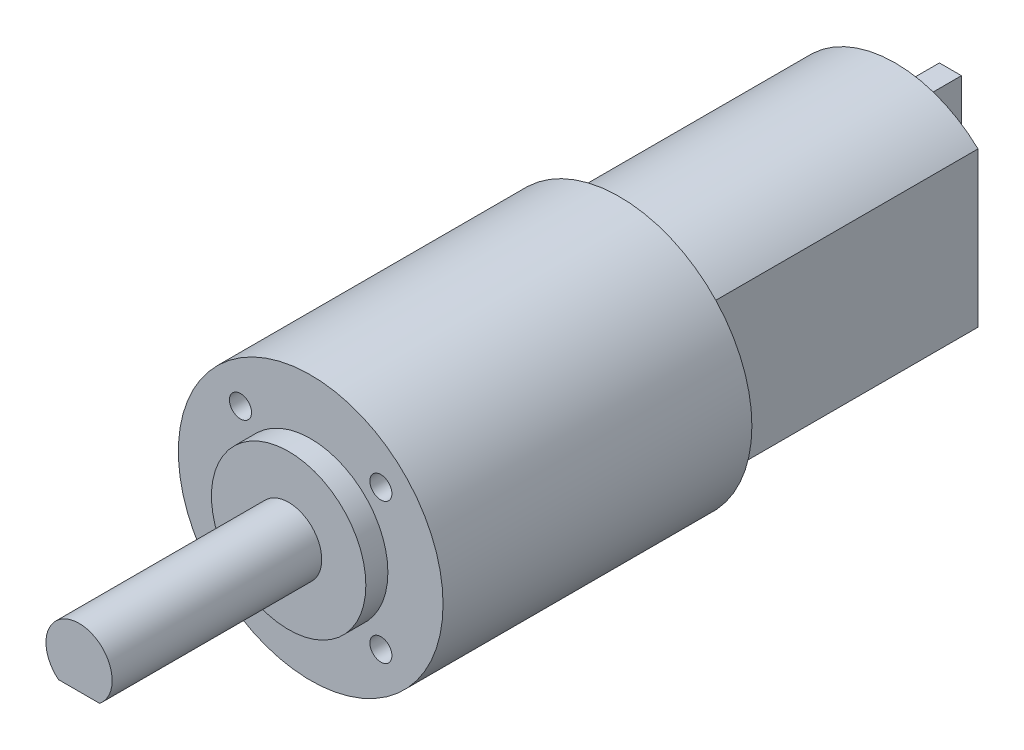
ISO-10303-21;
HEADER;
FILE_DESCRIPTION(('STEP AP214'),'2;1');
FILE_NAME('part.step','',(''),(''),'','','');
FILE_SCHEMA(('AUTOMOTIVE_DESIGN { 1 0 10303 214 1 1 1 1 }'));
ENDSEC;
DATA;
#1=APPLICATION_CONTEXT('core data for automotive mechanical design processes');
#2=APPLICATION_PROTOCOL_DEFINITION('international standard','automotive_design',2000,#1);
#3=PRODUCT_CONTEXT('',#1,'mechanical');
#4=PRODUCT('Part','Part','',(#3));
#5=PRODUCT_RELATED_PRODUCT_CATEGORY('part','',(#4));
#6=PRODUCT_DEFINITION_FORMATION('','',#4);
#7=PRODUCT_DEFINITION_CONTEXT('part definition',#1,'design');
#8=PRODUCT_DEFINITION('design','',#6,#7);
#9=PRODUCT_DEFINITION_SHAPE('','',#8);
#10=(LENGTH_UNIT() NAMED_UNIT(*) SI_UNIT(.MILLI.,.METRE.));
#11=(NAMED_UNIT(*) PLANE_ANGLE_UNIT() SI_UNIT($,.RADIAN.));
#12=(NAMED_UNIT(*) SI_UNIT($,.STERADIAN.) SOLID_ANGLE_UNIT());
#13=UNCERTAINTY_MEASURE_WITH_UNIT(LENGTH_MEASURE(1.E-05),#10,'distance_accuracy_value','');
#14=(GEOMETRIC_REPRESENTATION_CONTEXT(3) GLOBAL_UNCERTAINTY_ASSIGNED_CONTEXT((#13)) GLOBAL_UNIT_ASSIGNED_CONTEXT((#10,
#11,#12)) REPRESENTATION_CONTEXT('',''));
#15=CARTESIAN_POINT('',(0.,0.,0.));
#16=DIRECTION('',(0.,0.,1.));
#17=DIRECTION('',(1.,0.,0.));
#18=AXIS2_PLACEMENT_3D('',#15,#16,#17);
#19=CARTESIAN_POINT('',(0.,-0.875000000000001,0.));
#20=DIRECTION('',(0.,0.,-1.));
#21=DIRECTION('',(-1.,0.,0.));
#22=AXIS2_PLACEMENT_3D('',#19,#20,#21);
#23=PLANE('',#22);
#24=CARTESIAN_POINT('',(0.,-0.875000000000001,0.));
#25=DIRECTION('',(0.,0.,1.));
#26=DIRECTION('',(-1.,0.,0.));
#27=AXIS2_PLACEMENT_3D('',#24,#25,#26);
#28=CIRCLE('',#27,10.875);
#29=CARTESIAN_POINT('',(7.5,7.,0.));
#30=VERTEX_POINT('',#29);
#31=CARTESIAN_POINT('',(-7.5,7.,0.));
#32=VERTEX_POINT('',#31);
#33=EDGE_CURVE('E297',#30,#32,#28,.T.);
#34=ORIENTED_EDGE('',*,*,#33,.F.);
#35=DIRECTION('',(0.,1.,0.));
#36=VECTOR('',#35,1.);
#37=CARTESIAN_POINT('',(7.5,-7.,0.));
#38=LINE('',#37,#36);
#39=CARTESIAN_POINT('',(7.5,-7.,0.));
#40=VERTEX_POINT('',#39);
#41=EDGE_CURVE('E303',#40,#30,#38,.T.);
#42=ORIENTED_EDGE('',*,*,#41,.F.);
#43=CARTESIAN_POINT('',(0.,0.875000000000004,0.));
#44=DIRECTION('',(0.,0.,1.));
#45=DIRECTION('',(1.,0.,0.));
#46=AXIS2_PLACEMENT_3D('',#43,#44,#45);
#47=CIRCLE('',#46,10.875);
#48=CARTESIAN_POINT('',(-7.5,-7.,0.));
#49=VERTEX_POINT('',#48);
#50=EDGE_CURVE('E322',#49,#40,#47,.T.);
#51=ORIENTED_EDGE('',*,*,#50,.F.);
#52=DIRECTION('',(0.,-1.,0.));
#53=VECTOR('',#52,1.);
#54=CARTESIAN_POINT('',(-7.5,-7.,0.));
#55=LINE('',#54,#53);
#56=EDGE_CURVE('E319',#32,#49,#55,.T.);
#57=ORIENTED_EDGE('',*,*,#56,.F.);
#58=EDGE_LOOP('',(#34,#42,#51,#57));
#59=FACE_BOUND('',#58,.T.);
#60=DIRECTION('',(-1.,0.,0.));
#61=VECTOR('',#60,1.);
#62=CARTESIAN_POINT('',(-1.,3.,0.));
#63=LINE('',#62,#61);
#64=CARTESIAN_POINT('',(1.,3.,0.));
#65=VERTEX_POINT('',#64);
#66=CARTESIAN_POINT('',(-1.,3.,0.));
#67=VERTEX_POINT('',#66);
#68=EDGE_CURVE('E275',#65,#67,#63,.T.);
#69=ORIENTED_EDGE('',*,*,#68,.F.);
#70=DIRECTION('',(0.,-1.,0.));
#71=VECTOR('',#70,1.);
#72=CARTESIAN_POINT('',(1.,3.,0.));
#73=LINE('',#72,#71);
#74=CARTESIAN_POINT('',(1.,7.,0.));
#75=VERTEX_POINT('',#74);
#76=EDGE_CURVE('E245',#75,#65,#73,.T.);
#77=ORIENTED_EDGE('',*,*,#76,.F.);
#78=DIRECTION('',(1.,0.,0.));
#79=VECTOR('',#78,1.);
#80=CARTESIAN_POINT('',(-1.,7.,0.));
#81=LINE('',#80,#79);
#82=CARTESIAN_POINT('',(-1.,7.,0.));
#83=VERTEX_POINT('',#82);
#84=EDGE_CURVE('E262',#83,#75,#81,.T.);
#85=ORIENTED_EDGE('',*,*,#84,.F.);
#86=DIRECTION('',(0.,1.,0.));
#87=VECTOR('',#86,1.);
#88=CARTESIAN_POINT('',(-1.,3.,0.));
#89=LINE('',#88,#87);
#90=EDGE_CURVE('E278',#67,#83,#89,.T.);
#91=ORIENTED_EDGE('',*,*,#90,.F.);
#92=EDGE_LOOP('',(#69,#77,#85,#91));
#93=FACE_BOUND('',#92,.T.);
#94=DIRECTION('',(1.,0.,0.));
#95=VECTOR('',#94,1.);
#96=CARTESIAN_POINT('',(-1.,-3.,0.));
#97=LINE('',#96,#95);
#98=CARTESIAN_POINT('',(-1.,-3.,0.));
#99=VERTEX_POINT('',#98);
#100=CARTESIAN_POINT('',(1.,-3.,0.));
#101=VERTEX_POINT('',#100);
#102=EDGE_CURVE('E238',#99,#101,#97,.T.);
#103=ORIENTED_EDGE('',*,*,#102,.F.);
#104=DIRECTION('',(0.,1.,0.));
#105=VECTOR('',#104,1.);
#106=CARTESIAN_POINT('',(-1.,-3.,0.));
#107=LINE('',#106,#105);
#108=CARTESIAN_POINT('',(-1.,-7.,0.));
#109=VERTEX_POINT('',#108);
#110=EDGE_CURVE('E241',#109,#99,#107,.T.);
#111=ORIENTED_EDGE('',*,*,#110,.F.);
#112=DIRECTION('',(-1.,0.,0.));
#113=VECTOR('',#112,1.);
#114=CARTESIAN_POINT('',(-1.,-7.,0.));
#115=LINE('',#114,#113);
#116=CARTESIAN_POINT('',(1.,-7.,0.));
#117=VERTEX_POINT('',#116);
#118=EDGE_CURVE('E231',#117,#109,#115,.T.);
#119=ORIENTED_EDGE('',*,*,#118,.F.);
#120=DIRECTION('',(0.,-1.,0.));
#121=VECTOR('',#120,1.);
#122=CARTESIAN_POINT('',(1.,-3.,0.));
#123=LINE('',#122,#121);
#124=EDGE_CURVE('E234',#101,#117,#123,.T.);
#125=ORIENTED_EDGE('',*,*,#124,.F.);
#126=EDGE_LOOP('',(#103,#111,#119,#125));
#127=FACE_BOUND('',#126,.T.);
#128=ADVANCED_FACE('F45',(#59,#93,#127),#23,.T.);
#129=CARTESIAN_POINT('',(0.,-0.875000000000001,25.));
#130=DIRECTION('',(0.,0.,-1.));
#131=DIRECTION('',(-1.,0.,0.));
#132=AXIS2_PLACEMENT_3D('',#129,#130,#131);
#133=CYLINDRICAL_SURFACE('',#132,10.875);
#134=ORIENTED_EDGE('',*,*,#33,.T.);
#135=DIRECTION('',(0.,0.,-1.));
#136=VECTOR('',#135,1.);
#137=CARTESIAN_POINT('',(-7.5,7.,25.));
#138=LINE('',#137,#136);
#139=CARTESIAN_POINT('',(-7.5,7.,25.));
#140=VERTEX_POINT('',#139);
#141=EDGE_CURVE('E49',#140,#32,#138,.T.);
#142=ORIENTED_EDGE('',*,*,#141,.F.);
#143=CARTESIAN_POINT('',(0.,-0.875000000000001,25.));
#144=DIRECTION('',(0.,0.,1.));
#145=DIRECTION('',(-1.,0.,0.));
#146=AXIS2_PLACEMENT_3D('',#143,#144,#145);
#147=CIRCLE('',#146,10.875);
#148=CARTESIAN_POINT('',(7.5,7.,25.));
#149=VERTEX_POINT('',#148);
#150=EDGE_CURVE('E298',#149,#140,#147,.T.);
#151=ORIENTED_EDGE('',*,*,#150,.F.);
#152=DIRECTION('',(0.,0.,-1.));
#153=VECTOR('',#152,1.);
#154=CARTESIAN_POINT('',(7.5,7.,25.));
#155=LINE('',#154,#153);
#156=EDGE_CURVE('E315',#149,#30,#155,.T.);
#157=ORIENTED_EDGE('',*,*,#156,.T.);
#158=EDGE_LOOP('',(#134,#142,#151,#157));
#159=FACE_BOUND('',#158,.T.);
#160=ADVANCED_FACE('F47',(#159),#133,.T.);
#161=CARTESIAN_POINT('',(-7.5,-7.,25.));
#162=DIRECTION('',(1.,0.,0.));
#163=DIRECTION('',(0.,0.,-1.));
#164=AXIS2_PLACEMENT_3D('',#161,#162,#163);
#165=PLANE('',#164);
#166=ORIENTED_EDGE('',*,*,#56,.T.);
#167=DIRECTION('',(0.,0.,-1.));
#168=VECTOR('',#167,1.);
#169=CARTESIAN_POINT('',(-7.5,-7.,25.));
#170=LINE('',#169,#168);
#171=CARTESIAN_POINT('',(-7.5,-7.,25.));
#172=VERTEX_POINT('',#171);
#173=EDGE_CURVE('E333',#172,#49,#170,.T.);
#174=ORIENTED_EDGE('',*,*,#173,.F.);
#175=DIRECTION('',(0.,-1.,0.));
#176=VECTOR('',#175,1.);
#177=CARTESIAN_POINT('',(-7.5,-7.,25.));
#178=LINE('',#177,#176);
#179=EDGE_CURVE('E302',#140,#172,#178,.T.);
#180=ORIENTED_EDGE('',*,*,#179,.F.);
#181=ORIENTED_EDGE('',*,*,#141,.T.);
#182=EDGE_LOOP('',(#166,#174,#180,#181));
#183=FACE_BOUND('',#182,.T.);
#184=ADVANCED_FACE('F343',(#183),#165,.F.);
#185=CARTESIAN_POINT('',(0.,0.875000000000004,25.));
#186=DIRECTION('',(0.,0.,-1.));
#187=DIRECTION('',(-1.,0.,0.));
#188=AXIS2_PLACEMENT_3D('',#185,#186,#187);
#189=CYLINDRICAL_SURFACE('',#188,10.875);
#190=ORIENTED_EDGE('',*,*,#50,.T.);
#191=DIRECTION('',(0.,0.,-1.));
#192=VECTOR('',#191,1.);
#193=CARTESIAN_POINT('',(7.5,-7.,25.));
#194=LINE('',#193,#192);
#195=CARTESIAN_POINT('',(7.5,-7.,25.));
#196=VERTEX_POINT('',#195);
#197=EDGE_CURVE('E330',#196,#40,#194,.T.);
#198=ORIENTED_EDGE('',*,*,#197,.F.);
#199=CARTESIAN_POINT('',(0.,0.875000000000004,25.));
#200=DIRECTION('',(0.,0.,1.));
#201=DIRECTION('',(1.,0.,0.));
#202=AXIS2_PLACEMENT_3D('',#199,#200,#201);
#203=CIRCLE('',#202,10.875);
#204=EDGE_CURVE('E307',#172,#196,#203,.T.);
#205=ORIENTED_EDGE('',*,*,#204,.F.);
#206=ORIENTED_EDGE('',*,*,#173,.T.);
#207=EDGE_LOOP('',(#190,#198,#205,#206));
#208=FACE_BOUND('',#207,.T.);
#209=ADVANCED_FACE('F350',(#208),#189,.T.);
#210=CARTESIAN_POINT('',(7.5,-7.,25.));
#211=DIRECTION('',(-1.,0.,0.));
#212=DIRECTION('',(0.,0.,1.));
#213=AXIS2_PLACEMENT_3D('',#210,#211,#212);
#214=PLANE('',#213);
#215=ORIENTED_EDGE('',*,*,#41,.T.);
#216=ORIENTED_EDGE('',*,*,#156,.F.);
#217=DIRECTION('',(0.,1.,0.));
#218=VECTOR('',#217,1.);
#219=CARTESIAN_POINT('',(7.5,-7.,25.));
#220=LINE('',#219,#218);
#221=EDGE_CURVE('E311',#196,#149,#220,.T.);
#222=ORIENTED_EDGE('',*,*,#221,.F.);
#223=ORIENTED_EDGE('',*,*,#197,.T.);
#224=EDGE_LOOP('',(#215,#216,#222,#223));
#225=FACE_BOUND('',#224,.T.);
#226=ADVANCED_FACE('F353',(#225),#214,.F.);
#227=CARTESIAN_POINT('',(1.,3.,-5.));
#228=DIRECTION('',(-1.,0.,0.));
#229=DIRECTION('',(0.,-1.,0.));
#230=AXIS2_PLACEMENT_3D('',#227,#228,#229);
#231=PLANE('',#230);
#232=ORIENTED_EDGE('',*,*,#76,.T.);
#233=DIRECTION('',(0.,0.,1.));
#234=VECTOR('',#233,1.);
#235=CARTESIAN_POINT('',(1.,3.,-5.));
#236=LINE('',#235,#234);
#237=CARTESIAN_POINT('',(1.,3.,-5.));
#238=VERTEX_POINT('',#237);
#239=EDGE_CURVE('E294',#238,#65,#236,.T.);
#240=ORIENTED_EDGE('',*,*,#239,.F.);
#241=DIRECTION('',(0.,-1.,0.));
#242=VECTOR('',#241,1.);
#243=CARTESIAN_POINT('',(1.,3.,-5.));
#244=LINE('',#243,#242);
#245=CARTESIAN_POINT('',(1.,7.,-5.));
#246=VERTEX_POINT('',#245);
#247=EDGE_CURVE('E257',#246,#238,#244,.T.);
#248=ORIENTED_EDGE('',*,*,#247,.F.);
#249=DIRECTION('',(0.,0.,1.));
#250=VECTOR('',#249,1.);
#251=CARTESIAN_POINT('',(1.,7.,-5.));
#252=LINE('',#251,#250);
#253=EDGE_CURVE('E271',#246,#75,#252,.T.);
#254=ORIENTED_EDGE('',*,*,#253,.T.);
#255=EDGE_LOOP('',(#232,#240,#248,#254));
#256=FACE_BOUND('',#255,.T.);
#257=ADVANCED_FACE('F382',(#256),#231,.F.);
#258=CARTESIAN_POINT('',(-1.,3.,-5.));
#259=DIRECTION('',(0.,1.,0.));
#260=DIRECTION('',(0.,0.,1.));
#261=AXIS2_PLACEMENT_3D('',#258,#259,#260);
#262=PLANE('',#261);
#263=ORIENTED_EDGE('',*,*,#68,.T.);
#264=DIRECTION('',(0.,0.,1.));
#265=VECTOR('',#264,1.);
#266=CARTESIAN_POINT('',(-1.,3.,-5.));
#267=LINE('',#266,#265);
#268=CARTESIAN_POINT('',(-1.,3.,-5.));
#269=VERTEX_POINT('',#268);
#270=EDGE_CURVE('E290',#269,#67,#267,.T.);
#271=ORIENTED_EDGE('',*,*,#270,.F.);
#272=DIRECTION('',(-1.,0.,0.));
#273=VECTOR('',#272,1.);
#274=CARTESIAN_POINT('',(-1.,3.,-5.));
#275=LINE('',#274,#273);
#276=EDGE_CURVE('E261',#238,#269,#275,.T.);
#277=ORIENTED_EDGE('',*,*,#276,.F.);
#278=ORIENTED_EDGE('',*,*,#239,.T.);
#279=EDGE_LOOP('',(#263,#271,#277,#278));
#280=FACE_BOUND('',#279,.T.);
#281=ADVANCED_FACE('F414',(#280),#262,.F.);
#282=CARTESIAN_POINT('',(-1.,3.,-5.));
#283=DIRECTION('',(1.,0.,0.));
#284=DIRECTION('',(0.,1.,0.));
#285=AXIS2_PLACEMENT_3D('',#282,#283,#284);
#286=PLANE('',#285);
#287=ORIENTED_EDGE('',*,*,#90,.T.);
#288=DIRECTION('',(0.,0.,1.));
#289=VECTOR('',#288,1.);
#290=CARTESIAN_POINT('',(-1.,7.,-5.));
#291=LINE('',#290,#289);
#292=CARTESIAN_POINT('',(-1.,7.,-5.));
#293=VERTEX_POINT('',#292);
#294=EDGE_CURVE('E287',#293,#83,#291,.T.);
#295=ORIENTED_EDGE('',*,*,#294,.F.);
#296=DIRECTION('',(0.,1.,0.));
#297=VECTOR('',#296,1.);
#298=CARTESIAN_POINT('',(-1.,3.,-5.));
#299=LINE('',#298,#297);
#300=EDGE_CURVE('E265',#269,#293,#299,.T.);
#301=ORIENTED_EDGE('',*,*,#300,.F.);
#302=ORIENTED_EDGE('',*,*,#270,.T.);
#303=EDGE_LOOP('',(#287,#295,#301,#302));
#304=FACE_BOUND('',#303,.T.);
#305=ADVANCED_FACE('F423',(#304),#286,.F.);
#306=CARTESIAN_POINT('',(-1.,7.,-5.));
#307=DIRECTION('',(0.,-1.,0.));
#308=DIRECTION('',(0.,0.,-1.));
#309=AXIS2_PLACEMENT_3D('',#306,#307,#308);
#310=PLANE('',#309);
#311=ORIENTED_EDGE('',*,*,#84,.T.);
#312=ORIENTED_EDGE('',*,*,#253,.F.);
#313=DIRECTION('',(1.,0.,0.));
#314=VECTOR('',#313,1.);
#315=CARTESIAN_POINT('',(-1.,7.,-5.));
#316=LINE('',#315,#314);
#317=EDGE_CURVE('E268',#293,#246,#316,.T.);
#318=ORIENTED_EDGE('',*,*,#317,.F.);
#319=ORIENTED_EDGE('',*,*,#294,.T.);
#320=EDGE_LOOP('',(#311,#312,#318,#319));
#321=FACE_BOUND('',#320,.T.);
#322=ADVANCED_FACE('F432',(#321),#310,.F.);
#323=CARTESIAN_POINT('',(0.,0.,-5.));
#324=DIRECTION('',(0.,0.,-1.));
#325=DIRECTION('',(-1.,0.,0.));
#326=AXIS2_PLACEMENT_3D('',#323,#324,#325);
#327=PLANE('',#326);
#328=ORIENTED_EDGE('',*,*,#247,.T.);
#329=ORIENTED_EDGE('',*,*,#276,.T.);
#330=ORIENTED_EDGE('',*,*,#300,.T.);
#331=ORIENTED_EDGE('',*,*,#317,.T.);
#332=EDGE_LOOP('',(#328,#329,#330,#331));
#333=FACE_BOUND('',#332,.T.);
#334=ADVANCED_FACE('F442',(#333),#327,.T.);
#335=CARTESIAN_POINT('',(-1.,-3.,-5.));
#336=DIRECTION('',(1.,0.,0.));
#337=DIRECTION('',(0.,1.,0.));
#338=AXIS2_PLACEMENT_3D('',#335,#336,#337);
#339=PLANE('',#338);
#340=ORIENTED_EDGE('',*,*,#110,.T.);
#341=DIRECTION('',(0.,0.,1.));
#342=VECTOR('',#341,1.);
#343=CARTESIAN_POINT('',(-1.,-3.,-5.));
#344=LINE('',#343,#342);
#345=CARTESIAN_POINT('',(-1.,-3.,-5.));
#346=VERTEX_POINT('',#345);
#347=EDGE_CURVE('E214',#346,#99,#344,.T.);
#348=ORIENTED_EDGE('',*,*,#347,.F.);
#349=DIRECTION('',(0.,1.,0.));
#350=VECTOR('',#349,1.);
#351=CARTESIAN_POINT('',(-1.,-3.,-5.));
#352=LINE('',#351,#350);
#353=CARTESIAN_POINT('',(-1.,-7.,-5.));
#354=VERTEX_POINT('',#353);
#355=EDGE_CURVE('E235',#354,#346,#352,.T.);
#356=ORIENTED_EDGE('',*,*,#355,.F.);
#357=DIRECTION('',(0.,0.,1.));
#358=VECTOR('',#357,1.);
#359=CARTESIAN_POINT('',(-1.,-7.,-5.));
#360=LINE('',#359,#358);
#361=EDGE_CURVE('E226',#354,#109,#360,.T.);
#362=ORIENTED_EDGE('',*,*,#361,.T.);
#363=EDGE_LOOP('',(#340,#348,#356,#362));
#364=FACE_BOUND('',#363,.T.);
#365=ADVANCED_FACE('F452',(#364),#339,.F.);
#366=CARTESIAN_POINT('',(-1.,-3.,-5.));
#367=DIRECTION('',(0.,-1.,0.));
#368=DIRECTION('',(0.,0.,-1.));
#369=AXIS2_PLACEMENT_3D('',#366,#367,#368);
#370=PLANE('',#369);
#371=ORIENTED_EDGE('',*,*,#102,.T.);
#372=DIRECTION('',(0.,0.,1.));
#373=VECTOR('',#372,1.);
#374=CARTESIAN_POINT('',(1.,-3.,-5.));
#375=LINE('',#374,#373);
#376=CARTESIAN_POINT('',(1.,-3.,-5.));
#377=VERTEX_POINT('',#376);
#378=EDGE_CURVE('E220',#377,#101,#375,.T.);
#379=ORIENTED_EDGE('',*,*,#378,.F.);
#380=DIRECTION('',(1.,0.,0.));
#381=VECTOR('',#380,1.);
#382=CARTESIAN_POINT('',(-1.,-3.,-5.));
#383=LINE('',#382,#381);
#384=EDGE_CURVE('E251',#346,#377,#383,.T.);
#385=ORIENTED_EDGE('',*,*,#384,.F.);
#386=ORIENTED_EDGE('',*,*,#347,.T.);
#387=EDGE_LOOP('',(#371,#379,#385,#386));
#388=FACE_BOUND('',#387,.T.);
#389=ADVANCED_FACE('F462',(#388),#370,.F.);
#390=CARTESIAN_POINT('',(1.,-3.,-5.));
#391=DIRECTION('',(-1.,0.,0.));
#392=DIRECTION('',(0.,-1.,0.));
#393=AXIS2_PLACEMENT_3D('',#390,#391,#392);
#394=PLANE('',#393);
#395=ORIENTED_EDGE('',*,*,#124,.T.);
#396=DIRECTION('',(0.,0.,1.));
#397=VECTOR('',#396,1.);
#398=CARTESIAN_POINT('',(1.,-7.,-5.));
#399=LINE('',#398,#397);
#400=CARTESIAN_POINT('',(1.,-7.,-5.));
#401=VERTEX_POINT('',#400);
#402=EDGE_CURVE('E69',#401,#117,#399,.T.);
#403=ORIENTED_EDGE('',*,*,#402,.F.);
#404=DIRECTION('',(0.,-1.,0.));
#405=VECTOR('',#404,1.);
#406=CARTESIAN_POINT('',(1.,-3.,-5.));
#407=LINE('',#406,#405);
#408=EDGE_CURVE('E248',#377,#401,#407,.T.);
#409=ORIENTED_EDGE('',*,*,#408,.F.);
#410=ORIENTED_EDGE('',*,*,#378,.T.);
#411=EDGE_LOOP('',(#395,#403,#409,#410));
#412=FACE_BOUND('',#411,.T.);
#413=ADVANCED_FACE('F472',(#412),#394,.F.);
#414=CARTESIAN_POINT('',(-1.,-7.,-5.));
#415=DIRECTION('',(0.,1.,0.));
#416=DIRECTION('',(-1.,0.,0.));
#417=AXIS2_PLACEMENT_3D('',#414,#415,#416);
#418=PLANE('',#417);
#419=ORIENTED_EDGE('',*,*,#118,.T.);
#420=ORIENTED_EDGE('',*,*,#361,.F.);
#421=DIRECTION('',(-1.,0.,0.));
#422=VECTOR('',#421,1.);
#423=CARTESIAN_POINT('',(-1.,-7.,-5.));
#424=LINE('',#423,#422);
#425=EDGE_CURVE('E230',#401,#354,#424,.T.);
#426=ORIENTED_EDGE('',*,*,#425,.F.);
#427=ORIENTED_EDGE('',*,*,#402,.T.);
#428=EDGE_LOOP('',(#419,#420,#426,#427));
#429=FACE_BOUND('',#428,.T.);
#430=ADVANCED_FACE('F369',(#429),#418,.F.);
#431=CARTESIAN_POINT('',(0.,0.,-5.));
#432=DIRECTION('',(0.,0.,1.));
#433=DIRECTION('',(1.,0.,0.));
#434=AXIS2_PLACEMENT_3D('',#431,#432,#433);
#435=PLANE('',#434);
#436=ORIENTED_EDGE('',*,*,#355,.T.);
#437=ORIENTED_EDGE('',*,*,#384,.T.);
#438=ORIENTED_EDGE('',*,*,#408,.T.);
#439=ORIENTED_EDGE('',*,*,#425,.T.);
#440=EDGE_LOOP('',(#436,#437,#438,#439));
#441=FACE_BOUND('',#440,.T.);
#442=ADVANCED_FACE('F358',(#441),#435,.F.);
#443=CARTESIAN_POINT('',(0.,0.,25.));
#444=DIRECTION('',(0.,0.,1.));
#445=DIRECTION('',(1.,0.,0.));
#446=AXIS2_PLACEMENT_3D('',#443,#444,#445);
#447=PLANE('',#446);
#448=CARTESIAN_POINT('',(0.,0.,25.));
#449=DIRECTION('',(0.,0.,1.));
#450=DIRECTION('',(1.,0.,0.));
#451=AXIS2_PLACEMENT_3D('',#448,#449,#450);
#452=CIRCLE('',#451,12.);
#453=CARTESIAN_POINT('',(12.,0.,25.));
#454=VERTEX_POINT('',#453);
#455=EDGE_CURVE('E208',#454,#454,#452,.T.);
#456=ORIENTED_EDGE('',*,*,#455,.F.);
#457=EDGE_LOOP('',(#456));
#458=FACE_BOUND('',#457,.T.);
#459=ORIENTED_EDGE('',*,*,#221,.T.);
#460=ORIENTED_EDGE('',*,*,#150,.T.);
#461=ORIENTED_EDGE('',*,*,#179,.T.);
#462=ORIENTED_EDGE('',*,*,#204,.T.);
#463=EDGE_LOOP('',(#459,#460,#461,#462));
#464=FACE_BOUND('',#463,.T.);
#465=ADVANCED_FACE('F355',(#458,#464),#447,.F.);
#466=CARTESIAN_POINT('',(0.,0.,53.));
#467=DIRECTION('',(0.,0.,-1.));
#468=DIRECTION('',(-1.,0.,0.));
#469=AXIS2_PLACEMENT_3D('',#466,#467,#468);
#470=CYLINDRICAL_SURFACE('',#469,12.);
#471=CARTESIAN_POINT('',(0.,0.,53.));
#472=DIRECTION('',(0.,0.,1.));
#473=DIRECTION('',(1.,0.,0.));
#474=AXIS2_PLACEMENT_3D('',#471,#472,#473);
#475=CIRCLE('',#474,12.);
#476=CARTESIAN_POINT('',(12.,0.,53.));
#477=VERTEX_POINT('',#476);
#478=EDGE_CURVE('E210',#477,#477,#475,.T.);
#479=ORIENTED_EDGE('',*,*,#478,.F.);
#480=EDGE_LOOP('',(#479));
#481=FACE_BOUND('',#480,.T.);
#482=ORIENTED_EDGE('',*,*,#455,.T.);
#483=EDGE_LOOP('',(#482));
#484=FACE_BOUND('',#483,.T.);
#485=ADVANCED_FACE('F357',(#481,#484),#470,.T.);
#486=CARTESIAN_POINT('',(0.,0.,53.));
#487=DIRECTION('',(0.,0.,1.));
#488=DIRECTION('',(1.,0.,0.));
#489=AXIS2_PLACEMENT_3D('',#486,#487,#488);
#490=PLANE('',#489);
#491=CARTESIAN_POINT('',(6.36396103067896,-6.36396103067889,53.));
#492=DIRECTION('',(0.,0.,1.));
#493=DIRECTION('',(1.,0.,0.));
#494=AXIS2_PLACEMENT_3D('',#491,#492,#493);
#495=CIRCLE('',#494,1.);
#496=CARTESIAN_POINT('',(7.36396103067896,-6.36396103067889,53.));
#497=VERTEX_POINT('',#496);
#498=EDGE_CURVE('E182',#497,#497,#495,.T.);
#499=ORIENTED_EDGE('',*,*,#498,.F.);
#500=EDGE_LOOP('',(#499));
#501=FACE_BOUND('',#500,.T.);
#502=CARTESIAN_POINT('',(-6.36396103067896,6.36396103067889,53.));
#503=DIRECTION('',(0.,0.,1.));
#504=DIRECTION('',(1.,0.,0.));
#505=AXIS2_PLACEMENT_3D('',#502,#503,#504);
#506=CIRCLE('',#505,1.);
#507=CARTESIAN_POINT('',(-5.36396103067896,6.36396103067889,53.));
#508=VERTEX_POINT('',#507);
#509=EDGE_CURVE('E191',#508,#508,#506,.T.);
#510=ORIENTED_EDGE('',*,*,#509,.F.);
#511=EDGE_LOOP('',(#510));
#512=FACE_BOUND('',#511,.T.);
#513=CARTESIAN_POINT('',(-6.36396103067891,-6.36396103067894,53.));
#514=DIRECTION('',(0.,0.,1.));
#515=DIRECTION('',(1.,0.,0.));
#516=AXIS2_PLACEMENT_3D('',#513,#514,#515);
#517=CIRCLE('',#516,0.999999999999999);
#518=CARTESIAN_POINT('',(-5.36396103067891,-6.36396103067894,53.));
#519=VERTEX_POINT('',#518);
#520=EDGE_CURVE('E173',#519,#519,#517,.T.);
#521=ORIENTED_EDGE('',*,*,#520,.F.);
#522=EDGE_LOOP('',(#521));
#523=FACE_BOUND('',#522,.T.);
#524=CARTESIAN_POINT('',(6.36396103067891,6.36396103067894,53.));
#525=DIRECTION('',(0.,0.,1.));
#526=DIRECTION('',(1.,0.,0.));
#527=AXIS2_PLACEMENT_3D('',#524,#525,#526);
#528=CIRCLE('',#527,0.999999999999999);
#529=CARTESIAN_POINT('',(7.36396103067891,6.36396103067894,53.));
#530=VERTEX_POINT('',#529);
#531=EDGE_CURVE('E186',#530,#530,#528,.T.);
#532=ORIENTED_EDGE('',*,*,#531,.F.);
#533=EDGE_LOOP('',(#532));
#534=FACE_BOUND('',#533,.T.);
#535=CARTESIAN_POINT('',(0.,0.,53.));
#536=DIRECTION('',(0.,0.,1.));
#537=DIRECTION('',(1.,0.,0.));
#538=AXIS2_PLACEMENT_3D('',#535,#536,#537);
#539=CIRCLE('',#538,7.);
#540=CARTESIAN_POINT('',(7.,0.,53.));
#541=VERTEX_POINT('',#540);
#542=EDGE_CURVE('E11',#541,#541,#539,.T.);
#543=ORIENTED_EDGE('',*,*,#542,.F.);
#544=EDGE_LOOP('',(#543));
#545=FACE_BOUND('',#544,.T.);
#546=ORIENTED_EDGE('',*,*,#478,.T.);
#547=EDGE_LOOP('',(#546));
#548=FACE_BOUND('',#547,.T.);
#549=ADVANCED_FACE('F365',(#501,#512,#523,#534,#545,#548),#490,.T.);
#550=CARTESIAN_POINT('',(0.,0.,55.));
#551=DIRECTION('',(0.,0.,-1.));
#552=DIRECTION('',(-1.,0.,0.));
#553=AXIS2_PLACEMENT_3D('',#550,#551,#552);
#554=CYLINDRICAL_SURFACE('',#553,7.);
#555=CARTESIAN_POINT('',(0.,0.,55.));
#556=DIRECTION('',(0.,0.,1.));
#557=DIRECTION('',(1.,0.,0.));
#558=AXIS2_PLACEMENT_3D('',#555,#556,#557);
#559=CIRCLE('',#558,7.);
#560=CARTESIAN_POINT('',(7.,0.,55.));
#561=VERTEX_POINT('',#560);
#562=EDGE_CURVE('E202',#561,#561,#559,.T.);
#563=ORIENTED_EDGE('',*,*,#562,.F.);
#564=EDGE_LOOP('',(#563));
#565=FACE_BOUND('',#564,.T.);
#566=ORIENTED_EDGE('',*,*,#542,.T.);
#567=EDGE_LOOP('',(#566));
#568=FACE_BOUND('',#567,.T.);
#569=ADVANCED_FACE('F516',(#565,#568),#554,.T.);
#570=CARTESIAN_POINT('',(0.,0.,55.));
#571=DIRECTION('',(0.,0.,1.));
#572=DIRECTION('',(1.,0.,0.));
#573=AXIS2_PLACEMENT_3D('',#570,#571,#572);
#574=PLANE('',#573);
#575=CARTESIAN_POINT('',(0.,0.,55.));
#576=DIRECTION('',(0.,0.,1.));
#577=DIRECTION('',(1.,0.,0.));
#578=AXIS2_PLACEMENT_3D('',#575,#576,#577);
#579=CIRCLE('',#578,3.);
#580=CARTESIAN_POINT('',(1.8575933160669,-2.35570521757362,55.));
#581=VERTEX_POINT('',#580);
#582=CARTESIAN_POINT('',(-1.8575933160669,-2.35570521757362,55.));
#583=VERTEX_POINT('',#582);
#584=EDGE_CURVE('E166',#581,#583,#579,.T.);
#585=ORIENTED_EDGE('',*,*,#584,.F.);
#586=DIRECTION('',(1.,0.,0.));
#587=VECTOR('',#586,1.);
#588=CARTESIAN_POINT('',(-1.8575933160669,-2.35570521757362,55.));
#589=LINE('',#588,#587);
#590=EDGE_CURVE('E61',#583,#581,#589,.T.);
#591=ORIENTED_EDGE('',*,*,#590,.F.);
#592=EDGE_LOOP('',(#585,#591));
#593=FACE_BOUND('',#592,.T.);
#594=ORIENTED_EDGE('',*,*,#562,.T.);
#595=EDGE_LOOP('',(#594));
#596=FACE_BOUND('',#595,.T.);
#597=ADVANCED_FACE('F525',(#593,#596),#574,.T.);
#598=CARTESIAN_POINT('',(6.36396103067891,6.36396103067894,48.));
#599=DIRECTION('',(0.,0.,1.));
#600=DIRECTION('',(1.,0.,0.));
#601=AXIS2_PLACEMENT_3D('',#598,#599,#600);
#602=CYLINDRICAL_SURFACE('',#601,0.999999999999999);
#603=CARTESIAN_POINT('',(6.36396103067891,6.36396103067894,48.));
#604=DIRECTION('',(0.,0.,1.));
#605=DIRECTION('',(1.,0.,0.));
#606=AXIS2_PLACEMENT_3D('',#603,#604,#605);
#607=CIRCLE('',#606,0.999999999999999);
#608=CARTESIAN_POINT('',(7.36396103067891,6.36396103067894,48.));
#609=VERTEX_POINT('',#608);
#610=EDGE_CURVE('E198',#609,#609,#607,.T.);
#611=ORIENTED_EDGE('',*,*,#610,.F.);
#612=EDGE_LOOP('',(#611));
#613=FACE_BOUND('',#612,.T.);
#614=ORIENTED_EDGE('',*,*,#531,.T.);
#615=EDGE_LOOP('',(#614));
#616=FACE_BOUND('',#615,.T.);
#617=ADVANCED_FACE('F535',(#613,#616),#602,.F.);
#618=CARTESIAN_POINT('',(6.36396103067891,6.36396103067894,48.));
#619=DIRECTION('',(0.,0.,1.));
#620=DIRECTION('',(1.,0.,0.));
#621=AXIS2_PLACEMENT_3D('',#618,#619,#620);
#622=PLANE('',#621);
#623=ORIENTED_EDGE('',*,*,#610,.T.);
#624=EDGE_LOOP('',(#623));
#625=FACE_BOUND('',#624,.T.);
#626=ADVANCED_FACE('F545',(#625),#622,.T.);
#627=CARTESIAN_POINT('',(-6.36396103067891,-6.36396103067894,48.));
#628=DIRECTION('',(0.,0.,1.));
#629=DIRECTION('',(1.,0.,0.));
#630=AXIS2_PLACEMENT_3D('',#627,#628,#629);
#631=CYLINDRICAL_SURFACE('',#630,0.999999999999999);
#632=CARTESIAN_POINT('',(-6.36396103067891,-6.36396103067894,48.));
#633=DIRECTION('',(0.,0.,1.));
#634=DIRECTION('',(1.,0.,0.));
#635=AXIS2_PLACEMENT_3D('',#632,#633,#634);
#636=CIRCLE('',#635,0.999999999999999);
#637=CARTESIAN_POINT('',(-5.36396103067891,-6.36396103067894,48.));
#638=VERTEX_POINT('',#637);
#639=EDGE_CURVE('E168',#638,#638,#636,.T.);
#640=ORIENTED_EDGE('',*,*,#639,.F.);
#641=EDGE_LOOP('',(#640));
#642=FACE_BOUND('',#641,.T.);
#643=ORIENTED_EDGE('',*,*,#520,.T.);
#644=EDGE_LOOP('',(#643));
#645=FACE_BOUND('',#644,.T.);
#646=ADVANCED_FACE('F555',(#642,#645),#631,.F.);
#647=CARTESIAN_POINT('',(-6.36396103067891,-6.36396103067894,48.));
#648=DIRECTION('',(0.,0.,1.));
#649=DIRECTION('',(1.,0.,0.));
#650=AXIS2_PLACEMENT_3D('',#647,#648,#649);
#651=PLANE('',#650);
#652=ORIENTED_EDGE('',*,*,#639,.T.);
#653=EDGE_LOOP('',(#652));
#654=FACE_BOUND('',#653,.T.);
#655=ADVANCED_FACE('F565',(#654),#651,.T.);
#656=CARTESIAN_POINT('',(-6.36396103067896,6.36396103067889,48.));
#657=DIRECTION('',(0.,0.,1.));
#658=DIRECTION('',(1.,0.,0.));
#659=AXIS2_PLACEMENT_3D('',#656,#657,#658);
#660=CYLINDRICAL_SURFACE('',#659,1.);
#661=CARTESIAN_POINT('',(-6.36396103067896,6.36396103067889,48.));
#662=DIRECTION('',(0.,0.,1.));
#663=DIRECTION('',(1.,0.,0.));
#664=AXIS2_PLACEMENT_3D('',#661,#662,#663);
#665=CIRCLE('',#664,1.);
#666=CARTESIAN_POINT('',(-5.36396103067896,6.36396103067889,48.));
#667=VERTEX_POINT('',#666);
#668=EDGE_CURVE('E180',#667,#667,#665,.T.);
#669=ORIENTED_EDGE('',*,*,#668,.F.);
#670=EDGE_LOOP('',(#669));
#671=FACE_BOUND('',#670,.T.);
#672=ORIENTED_EDGE('',*,*,#509,.T.);
#673=EDGE_LOOP('',(#672));
#674=FACE_BOUND('',#673,.T.);
#675=ADVANCED_FACE('F575',(#671,#674),#660,.F.);
#676=CARTESIAN_POINT('',(-6.36396103067896,6.36396103067889,48.));
#677=DIRECTION('',(0.,0.,1.));
#678=DIRECTION('',(1.,0.,0.));
#679=AXIS2_PLACEMENT_3D('',#676,#677,#678);
#680=PLANE('',#679);
#681=ORIENTED_EDGE('',*,*,#668,.T.);
#682=EDGE_LOOP('',(#681));
#683=FACE_BOUND('',#682,.T.);
#684=ADVANCED_FACE('F585',(#683),#680,.T.);
#685=CARTESIAN_POINT('',(6.36396103067896,-6.36396103067889,48.));
#686=DIRECTION('',(0.,0.,1.));
#687=DIRECTION('',(1.,0.,0.));
#688=AXIS2_PLACEMENT_3D('',#685,#686,#687);
#689=CYLINDRICAL_SURFACE('',#688,1.);
#690=CARTESIAN_POINT('',(6.36396103067896,-6.36396103067889,48.));
#691=DIRECTION('',(0.,0.,1.));
#692=DIRECTION('',(1.,0.,0.));
#693=AXIS2_PLACEMENT_3D('',#690,#691,#692);
#694=CIRCLE('',#693,1.);
#695=CARTESIAN_POINT('',(7.36396103067896,-6.36396103067889,48.));
#696=VERTEX_POINT('',#695);
#697=EDGE_CURVE('E187',#696,#696,#694,.T.);
#698=ORIENTED_EDGE('',*,*,#697,.F.);
#699=EDGE_LOOP('',(#698));
#700=FACE_BOUND('',#699,.T.);
#701=ORIENTED_EDGE('',*,*,#498,.T.);
#702=EDGE_LOOP('',(#701));
#703=FACE_BOUND('',#702,.T.);
#704=ADVANCED_FACE('F595',(#700,#703),#689,.F.);
#705=CARTESIAN_POINT('',(6.36396103067896,-6.36396103067889,48.));
#706=DIRECTION('',(0.,0.,1.));
#707=DIRECTION('',(1.,0.,0.));
#708=AXIS2_PLACEMENT_3D('',#705,#706,#707);
#709=PLANE('',#708);
#710=ORIENTED_EDGE('',*,*,#697,.T.);
#711=EDGE_LOOP('',(#710));
#712=FACE_BOUND('',#711,.T.);
#713=ADVANCED_FACE('F605',(#712),#709,.T.);
#714=CARTESIAN_POINT('',(0.,0.,74.));
#715=DIRECTION('',(0.,0.,-1.));
#716=DIRECTION('',(-1.,0.,0.));
#717=AXIS2_PLACEMENT_3D('',#714,#715,#716);
#718=CYLINDRICAL_SURFACE('',#717,3.);
#719=ORIENTED_EDGE('',*,*,#584,.T.);
#720=DIRECTION('',(0.,0.,-1.));
#721=VECTOR('',#720,1.);
#722=CARTESIAN_POINT('',(-1.8575933160669,-2.35570521757362,74.));
#723=LINE('',#722,#721);
#724=CARTESIAN_POINT('',(-1.8575933160669,-2.35570521757362,74.));
#725=VERTEX_POINT('',#724);
#726=EDGE_CURVE('E152',#725,#583,#723,.T.);
#727=ORIENTED_EDGE('',*,*,#726,.F.);
#728=CARTESIAN_POINT('',(0.,0.,74.));
#729=DIRECTION('',(0.,0.,1.));
#730=DIRECTION('',(1.,0.,0.));
#731=AXIS2_PLACEMENT_3D('',#728,#729,#730);
#732=CIRCLE('',#731,3.);
#733=CARTESIAN_POINT('',(1.8575933160669,-2.35570521757362,74.));
#734=VERTEX_POINT('',#733);
#735=EDGE_CURVE('E159',#734,#725,#732,.T.);
#736=ORIENTED_EDGE('',*,*,#735,.F.);
#737=DIRECTION('',(0.,0.,-1.));
#738=VECTOR('',#737,1.);
#739=CARTESIAN_POINT('',(1.8575933160669,-2.35570521757362,74.));
#740=LINE('',#739,#738);
#741=EDGE_CURVE('E155',#734,#581,#740,.T.);
#742=ORIENTED_EDGE('',*,*,#741,.T.);
#743=EDGE_LOOP('',(#719,#727,#736,#742));
#744=FACE_BOUND('',#743,.T.);
#745=ADVANCED_FACE('F165',(#744),#718,.T.);
#746=CARTESIAN_POINT('',(-1.8575933160669,-2.35570521757362,74.));
#747=DIRECTION('',(0.,1.,0.));
#748=DIRECTION('',(0.,0.,1.));
#749=AXIS2_PLACEMENT_3D('',#746,#747,#748);
#750=PLANE('',#749);
#751=ORIENTED_EDGE('',*,*,#590,.T.);
#752=ORIENTED_EDGE('',*,*,#741,.F.);
#753=DIRECTION('',(1.,0.,0.));
#754=VECTOR('',#753,1.);
#755=CARTESIAN_POINT('',(-1.8575933160669,-2.35570521757362,74.));
#756=LINE('',#755,#754);
#757=EDGE_CURVE('E148',#725,#734,#756,.T.);
#758=ORIENTED_EDGE('',*,*,#757,.F.);
#759=ORIENTED_EDGE('',*,*,#726,.T.);
#760=EDGE_LOOP('',(#751,#752,#758,#759));
#761=FACE_BOUND('',#760,.T.);
#762=ADVANCED_FACE('F150',(#761),#750,.F.);
#763=CARTESIAN_POINT('',(0.,0.,74.));
#764=DIRECTION('',(0.,0.,1.));
#765=DIRECTION('',(1.,0.,0.));
#766=AXIS2_PLACEMENT_3D('',#763,#764,#765);
#767=PLANE('',#766);
#768=ORIENTED_EDGE('',*,*,#735,.T.);
#769=ORIENTED_EDGE('',*,*,#757,.T.);
#770=EDGE_LOOP('',(#768,#769));
#771=FACE_BOUND('',#770,.T.);
#772=ADVANCED_FACE('F161',(#771),#767,.T.);
#773=CLOSED_SHELL('',(#128,#160,#184,#209,#226,#257,#281,#305,#322,#334,#365,#389,#413,#430,
#442,#465,#485,#549,#569,#597,#617,#626,#646,#655,#675,#684,#704,#713,#745,#762,#772));
#774=MANIFOLD_SOLID_BREP('B2',#773);
#775=ADVANCED_BREP_SHAPE_REPRESENTATION('',(#18,#774),#14);
#776=SHAPE_DEFINITION_REPRESENTATION(#9,#775);
ENDSEC;
END-ISO-10303-21;
